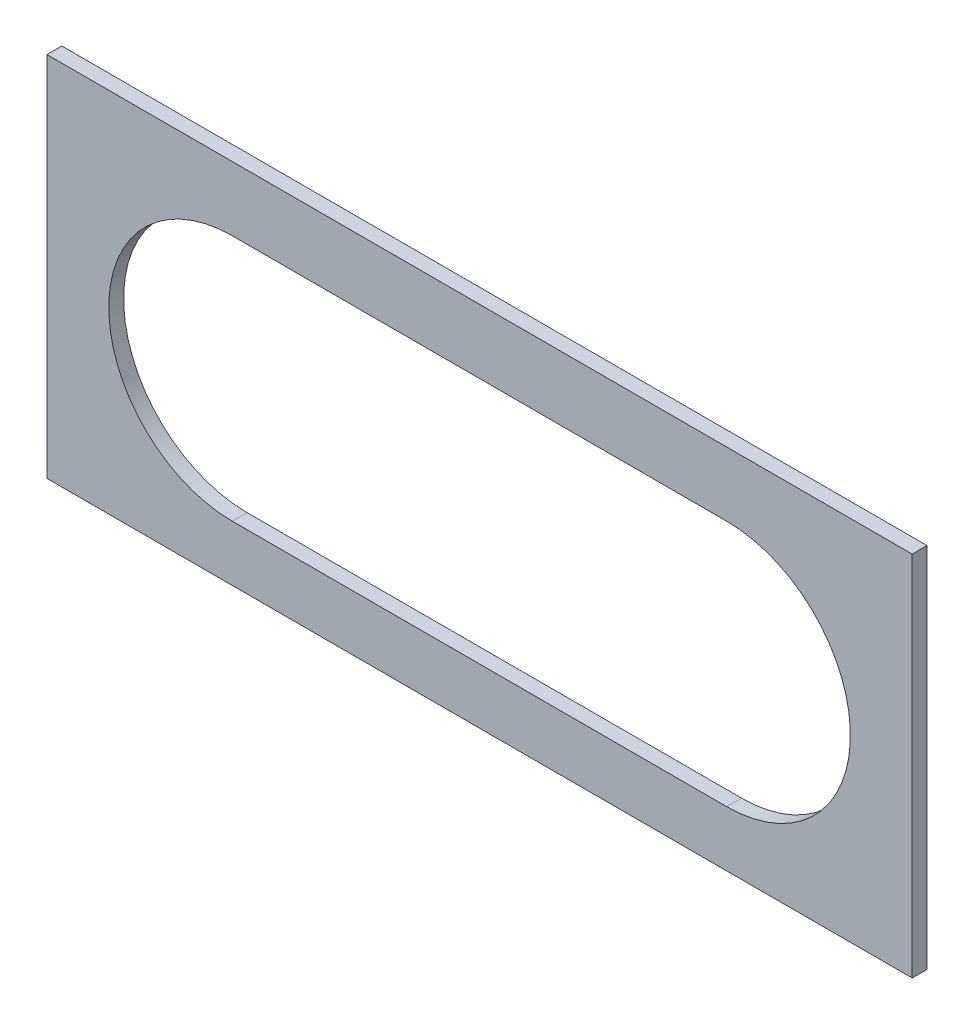
ISO-10303-21;
HEADER;
FILE_DESCRIPTION(('STEP AP214'),'2;1');
FILE_NAME('part.step','',(''),(''),'','','');
FILE_SCHEMA(('AUTOMOTIVE_DESIGN { 1 0 10303 214 1 1 1 1 }'));
ENDSEC;
DATA;
#1=APPLICATION_CONTEXT('core data for automotive mechanical design processes');
#2=APPLICATION_PROTOCOL_DEFINITION('international standard','automotive_design',2000,#1);
#3=PRODUCT_CONTEXT('',#1,'mechanical');
#4=PRODUCT('Part','Part','',(#3));
#5=PRODUCT_RELATED_PRODUCT_CATEGORY('part','',(#4));
#6=PRODUCT_DEFINITION_FORMATION('','',#4);
#7=PRODUCT_DEFINITION_CONTEXT('part definition',#1,'design');
#8=PRODUCT_DEFINITION('design','',#6,#7);
#9=PRODUCT_DEFINITION_SHAPE('','',#8);
#10=(LENGTH_UNIT() NAMED_UNIT(*) SI_UNIT(.MILLI.,.METRE.));
#11=(NAMED_UNIT(*) PLANE_ANGLE_UNIT() SI_UNIT($,.RADIAN.));
#12=(NAMED_UNIT(*) SI_UNIT($,.STERADIAN.) SOLID_ANGLE_UNIT());
#13=UNCERTAINTY_MEASURE_WITH_UNIT(LENGTH_MEASURE(1.E-05),#10,'distance_accuracy_value','');
#14=(GEOMETRIC_REPRESENTATION_CONTEXT(3) GLOBAL_UNCERTAINTY_ASSIGNED_CONTEXT((#13)) GLOBAL_UNIT_ASSIGNED_CONTEXT((#10,
#11,#12)) REPRESENTATION_CONTEXT('',''));
#15=CARTESIAN_POINT('',(0.,0.,0.));
#16=DIRECTION('',(0.,0.,1.));
#17=DIRECTION('',(1.,0.,0.));
#18=AXIS2_PLACEMENT_3D('',#15,#16,#17);
#19=CARTESIAN_POINT('',(0.,0.,12.));
#20=DIRECTION('',(0.,0.,1.));
#21=DIRECTION('',(1.,0.,0.));
#22=AXIS2_PLACEMENT_3D('',#19,#20,#21);
#23=PLANE('',#22);
#24=DIRECTION('',(0.,1.,0.));
#25=VECTOR('',#24,1.);
#26=CARTESIAN_POINT('',(350.,148.5,12.));
#27=LINE('',#26,#25);
#28=CARTESIAN_POINT('',(350.,-148.5,12.));
#29=VERTEX_POINT('',#28);
#30=CARTESIAN_POINT('',(350.,148.5,12.));
#31=VERTEX_POINT('',#30);
#32=EDGE_CURVE('E135',#29,#31,#27,.T.);
#33=ORIENTED_EDGE('',*,*,#32,.T.);
#34=DIRECTION('',(-1.,0.,0.));
#35=VECTOR('',#34,1.);
#36=CARTESIAN_POINT('',(-350.,148.5,12.));
#37=LINE('',#36,#35);
#38=CARTESIAN_POINT('',(-350.,148.5,12.));
#39=VERTEX_POINT('',#38);
#40=EDGE_CURVE('E138',#31,#39,#37,.T.);
#41=ORIENTED_EDGE('',*,*,#40,.T.);
#42=DIRECTION('',(0.,-1.,0.));
#43=VECTOR('',#42,1.);
#44=CARTESIAN_POINT('',(-350.,148.5,12.));
#45=LINE('',#44,#43);
#46=CARTESIAN_POINT('',(-350.,-148.5,12.));
#47=VERTEX_POINT('',#46);
#48=EDGE_CURVE('E141',#39,#47,#45,.T.);
#49=ORIENTED_EDGE('',*,*,#48,.T.);
#50=DIRECTION('',(1.,0.,0.));
#51=VECTOR('',#50,1.);
#52=CARTESIAN_POINT('',(-350.,-148.5,12.));
#53=LINE('',#52,#51);
#54=EDGE_CURVE('E143',#47,#29,#53,.T.);
#55=ORIENTED_EDGE('',*,*,#54,.T.);
#56=EDGE_LOOP('',(#33,#41,#49,#55));
#57=FACE_BOUND('',#56,.T.);
#58=DIRECTION('',(1.,0.,0.));
#59=VECTOR('',#58,1.);
#60=CARTESIAN_POINT('',(-200.,-103.5,12.));
#61=LINE('',#60,#59);
#62=CARTESIAN_POINT('',(-200.,-103.5,12.));
#63=VERTEX_POINT('',#62);
#64=CARTESIAN_POINT('',(200.,-103.5,12.));
#65=VERTEX_POINT('',#64);
#66=EDGE_CURVE('E107',#63,#65,#61,.T.);
#67=ORIENTED_EDGE('',*,*,#66,.F.);
#68=CARTESIAN_POINT('',(-200.,-3.50000000000003,12.));
#69=DIRECTION('',(0.,0.,1.));
#70=DIRECTION('',(1.,0.,0.));
#71=AXIS2_PLACEMENT_3D('',#68,#69,#70);
#72=CIRCLE('',#71,100.);
#73=CARTESIAN_POINT('',(-200.,96.5,12.));
#74=VERTEX_POINT('',#73);
#75=EDGE_CURVE('E99',#74,#63,#72,.T.);
#76=ORIENTED_EDGE('',*,*,#75,.F.);
#77=DIRECTION('',(-1.,0.,0.));
#78=VECTOR('',#77,1.);
#79=CARTESIAN_POINT('',(-200.,96.5,12.));
#80=LINE('',#79,#78);
#81=CARTESIAN_POINT('',(200.,96.4999999999999,12.));
#82=VERTEX_POINT('',#81);
#83=EDGE_CURVE('E121',#82,#74,#80,.T.);
#84=ORIENTED_EDGE('',*,*,#83,.F.);
#85=CARTESIAN_POINT('',(200.,-3.50000000000003,12.));
#86=DIRECTION('',(0.,0.,1.));
#87=DIRECTION('',(1.,0.,0.));
#88=AXIS2_PLACEMENT_3D('',#85,#86,#87);
#89=CIRCLE('',#88,100.);
#90=EDGE_CURVE('E119',#65,#82,#89,.T.);
#91=ORIENTED_EDGE('',*,*,#90,.F.);
#92=EDGE_LOOP('',(#67,#76,#84,#91));
#93=FACE_BOUND('',#92,.T.);
#94=ADVANCED_FACE('F34',(#57,#93),#23,.T.);
#95=CARTESIAN_POINT('',(0.,0.,0.));
#96=DIRECTION('',(0.,0.,1.));
#97=DIRECTION('',(1.,0.,0.));
#98=AXIS2_PLACEMENT_3D('',#95,#96,#97);
#99=PLANE('',#98);
#100=DIRECTION('',(0.,1.,0.));
#101=VECTOR('',#100,1.);
#102=CARTESIAN_POINT('',(350.,148.5,0.));
#103=LINE('',#102,#101);
#104=CARTESIAN_POINT('',(350.,-148.5,0.));
#105=VERTEX_POINT('',#104);
#106=CARTESIAN_POINT('',(350.,148.5,0.));
#107=VERTEX_POINT('',#106);
#108=EDGE_CURVE('E115',#105,#107,#103,.T.);
#109=ORIENTED_EDGE('',*,*,#108,.F.);
#110=DIRECTION('',(1.,0.,0.));
#111=VECTOR('',#110,1.);
#112=CARTESIAN_POINT('',(-350.,-148.5,0.));
#113=LINE('',#112,#111);
#114=CARTESIAN_POINT('',(-350.,-148.5,0.));
#115=VERTEX_POINT('',#114);
#116=EDGE_CURVE('E139',#115,#105,#113,.T.);
#117=ORIENTED_EDGE('',*,*,#116,.F.);
#118=DIRECTION('',(0.,-1.,0.));
#119=VECTOR('',#118,1.);
#120=CARTESIAN_POINT('',(-350.,148.5,0.));
#121=LINE('',#120,#119);
#122=CARTESIAN_POINT('',(-350.,148.5,0.));
#123=VERTEX_POINT('',#122);
#124=EDGE_CURVE('E150',#123,#115,#121,.T.);
#125=ORIENTED_EDGE('',*,*,#124,.F.);
#126=DIRECTION('',(-1.,0.,0.));
#127=VECTOR('',#126,1.);
#128=CARTESIAN_POINT('',(-350.,148.5,0.));
#129=LINE('',#128,#127);
#130=EDGE_CURVE('E148',#107,#123,#129,.T.);
#131=ORIENTED_EDGE('',*,*,#130,.F.);
#132=EDGE_LOOP('',(#109,#117,#125,#131));
#133=FACE_BOUND('',#132,.T.);
#134=CARTESIAN_POINT('',(-200.,-3.50000000000003,0.));
#135=DIRECTION('',(0.,0.,1.));
#136=DIRECTION('',(1.,0.,0.));
#137=AXIS2_PLACEMENT_3D('',#134,#135,#136);
#138=CIRCLE('',#137,100.);
#139=CARTESIAN_POINT('',(-200.,96.5,0.));
#140=VERTEX_POINT('',#139);
#141=CARTESIAN_POINT('',(-200.,-103.5,0.));
#142=VERTEX_POINT('',#141);
#143=EDGE_CURVE('E57',#140,#142,#138,.T.);
#144=ORIENTED_EDGE('',*,*,#143,.T.);
#145=DIRECTION('',(1.,0.,0.));
#146=VECTOR('',#145,1.);
#147=CARTESIAN_POINT('',(-200.,-103.5,0.));
#148=LINE('',#147,#146);
#149=CARTESIAN_POINT('',(200.,-103.5,0.));
#150=VERTEX_POINT('',#149);
#151=EDGE_CURVE('E114',#142,#150,#148,.T.);
#152=ORIENTED_EDGE('',*,*,#151,.T.);
#153=CARTESIAN_POINT('',(200.,-3.50000000000003,0.));
#154=DIRECTION('',(0.,0.,1.));
#155=DIRECTION('',(1.,0.,0.));
#156=AXIS2_PLACEMENT_3D('',#153,#154,#155);
#157=CIRCLE('',#156,100.);
#158=CARTESIAN_POINT('',(200.,96.4999999999999,0.));
#159=VERTEX_POINT('',#158);
#160=EDGE_CURVE('E127',#150,#159,#157,.T.);
#161=ORIENTED_EDGE('',*,*,#160,.T.);
#162=DIRECTION('',(-1.,0.,0.));
#163=VECTOR('',#162,1.);
#164=CARTESIAN_POINT('',(-200.,96.5,0.));
#165=LINE('',#164,#163);
#166=EDGE_CURVE('E108',#159,#140,#165,.T.);
#167=ORIENTED_EDGE('',*,*,#166,.T.);
#168=EDGE_LOOP('',(#144,#152,#161,#167));
#169=FACE_BOUND('',#168,.T.);
#170=ADVANCED_FACE('F168',(#133,#169),#99,.F.);
#171=CARTESIAN_POINT('',(350.,148.5,12.));
#172=DIRECTION('',(-1.,0.,0.));
#173=DIRECTION('',(0.,0.,1.));
#174=AXIS2_PLACEMENT_3D('',#171,#172,#173);
#175=PLANE('',#174);
#176=ORIENTED_EDGE('',*,*,#108,.T.);
#177=DIRECTION('',(0.,0.,-1.));
#178=VECTOR('',#177,1.);
#179=CARTESIAN_POINT('',(350.,148.5,12.));
#180=LINE('',#179,#178);
#181=EDGE_CURVE('E11',#31,#107,#180,.T.);
#182=ORIENTED_EDGE('',*,*,#181,.F.);
#183=ORIENTED_EDGE('',*,*,#32,.F.);
#184=DIRECTION('',(0.,0.,-1.));
#185=VECTOR('',#184,1.);
#186=CARTESIAN_POINT('',(350.,-148.5,12.));
#187=LINE('',#186,#185);
#188=EDGE_CURVE('E145',#29,#105,#187,.T.);
#189=ORIENTED_EDGE('',*,*,#188,.T.);
#190=EDGE_LOOP('',(#176,#182,#183,#189));
#191=FACE_BOUND('',#190,.T.);
#192=ADVANCED_FACE('F36',(#191),#175,.F.);
#193=CARTESIAN_POINT('',(-350.,148.5,12.));
#194=DIRECTION('',(0.,-1.,0.));
#195=DIRECTION('',(0.,0.,-1.));
#196=AXIS2_PLACEMENT_3D('',#193,#194,#195);
#197=PLANE('',#196);
#198=ORIENTED_EDGE('',*,*,#130,.T.);
#199=DIRECTION('',(0.,0.,-1.));
#200=VECTOR('',#199,1.);
#201=CARTESIAN_POINT('',(-350.,148.5,12.));
#202=LINE('',#201,#200);
#203=EDGE_CURVE('E42',#39,#123,#202,.T.);
#204=ORIENTED_EDGE('',*,*,#203,.F.);
#205=ORIENTED_EDGE('',*,*,#40,.F.);
#206=ORIENTED_EDGE('',*,*,#181,.T.);
#207=EDGE_LOOP('',(#198,#204,#205,#206));
#208=FACE_BOUND('',#207,.T.);
#209=ADVANCED_FACE('F178',(#208),#197,.F.);
#210=CARTESIAN_POINT('',(-350.,148.5,12.));
#211=DIRECTION('',(1.,0.,0.));
#212=DIRECTION('',(0.,1.,0.));
#213=AXIS2_PLACEMENT_3D('',#210,#211,#212);
#214=PLANE('',#213);
#215=ORIENTED_EDGE('',*,*,#124,.T.);
#216=DIRECTION('',(0.,0.,-1.));
#217=VECTOR('',#216,1.);
#218=CARTESIAN_POINT('',(-350.,-148.5,12.));
#219=LINE('',#218,#217);
#220=EDGE_CURVE('E155',#47,#115,#219,.T.);
#221=ORIENTED_EDGE('',*,*,#220,.F.);
#222=ORIENTED_EDGE('',*,*,#48,.F.);
#223=ORIENTED_EDGE('',*,*,#203,.T.);
#224=EDGE_LOOP('',(#215,#221,#222,#223));
#225=FACE_BOUND('',#224,.T.);
#226=ADVANCED_FACE('F162',(#225),#214,.F.);
#227=CARTESIAN_POINT('',(-350.,-148.5,12.));
#228=DIRECTION('',(0.,1.,0.));
#229=DIRECTION('',(0.,0.,1.));
#230=AXIS2_PLACEMENT_3D('',#227,#228,#229);
#231=PLANE('',#230);
#232=ORIENTED_EDGE('',*,*,#116,.T.);
#233=ORIENTED_EDGE('',*,*,#188,.F.);
#234=ORIENTED_EDGE('',*,*,#54,.F.);
#235=ORIENTED_EDGE('',*,*,#220,.T.);
#236=EDGE_LOOP('',(#232,#233,#234,#235));
#237=FACE_BOUND('',#236,.T.);
#238=ADVANCED_FACE('F172',(#237),#231,.F.);
#239=CARTESIAN_POINT('',(-200.,-3.50000000000003,12.));
#240=DIRECTION('',(0.,0.,-1.));
#241=DIRECTION('',(-1.,0.,0.));
#242=AXIS2_PLACEMENT_3D('',#239,#240,#241);
#243=CYLINDRICAL_SURFACE('',#242,100.);
#244=ORIENTED_EDGE('',*,*,#143,.F.);
#245=DIRECTION('',(0.,0.,-1.));
#246=VECTOR('',#245,1.);
#247=CARTESIAN_POINT('',(-200.,96.5,12.));
#248=LINE('',#247,#246);
#249=EDGE_CURVE('E103',#74,#140,#248,.T.);
#250=ORIENTED_EDGE('',*,*,#249,.F.);
#251=ORIENTED_EDGE('',*,*,#75,.T.);
#252=DIRECTION('',(0.,0.,-1.));
#253=VECTOR('',#252,1.);
#254=CARTESIAN_POINT('',(-200.,-103.5,12.));
#255=LINE('',#254,#253);
#256=EDGE_CURVE('E102',#63,#142,#255,.T.);
#257=ORIENTED_EDGE('',*,*,#256,.T.);
#258=EDGE_LOOP('',(#244,#250,#251,#257));
#259=FACE_BOUND('',#258,.T.);
#260=ADVANCED_FACE('F101',(#259),#243,.F.);
#261=CARTESIAN_POINT('',(-200.,-103.5,12.));
#262=DIRECTION('',(0.,1.,0.));
#263=DIRECTION('',(-1.,0.,0.));
#264=AXIS2_PLACEMENT_3D('',#261,#262,#263);
#265=PLANE('',#264);
#266=ORIENTED_EDGE('',*,*,#151,.F.);
#267=ORIENTED_EDGE('',*,*,#256,.F.);
#268=ORIENTED_EDGE('',*,*,#66,.T.);
#269=DIRECTION('',(0.,0.,-1.));
#270=VECTOR('',#269,1.);
#271=CARTESIAN_POINT('',(200.,-103.5,12.));
#272=LINE('',#271,#270);
#273=EDGE_CURVE('E116',#65,#150,#272,.T.);
#274=ORIENTED_EDGE('',*,*,#273,.T.);
#275=EDGE_LOOP('',(#266,#267,#268,#274));
#276=FACE_BOUND('',#275,.T.);
#277=ADVANCED_FACE('F111',(#276),#265,.T.);
#278=CARTESIAN_POINT('',(200.,-3.50000000000003,12.));
#279=DIRECTION('',(0.,0.,-1.));
#280=DIRECTION('',(-1.,0.,0.));
#281=AXIS2_PLACEMENT_3D('',#278,#279,#280);
#282=CYLINDRICAL_SURFACE('',#281,100.);
#283=ORIENTED_EDGE('',*,*,#160,.F.);
#284=ORIENTED_EDGE('',*,*,#273,.F.);
#285=ORIENTED_EDGE('',*,*,#90,.T.);
#286=DIRECTION('',(0.,0.,-1.));
#287=VECTOR('',#286,1.);
#288=CARTESIAN_POINT('',(200.,96.4999999999999,12.));
#289=LINE('',#288,#287);
#290=EDGE_CURVE('E49',#82,#159,#289,.T.);
#291=ORIENTED_EDGE('',*,*,#290,.T.);
#292=EDGE_LOOP('',(#283,#284,#285,#291));
#293=FACE_BOUND('',#292,.T.);
#294=ADVANCED_FACE('F201',(#293),#282,.F.);
#295=CARTESIAN_POINT('',(-200.,96.5,12.));
#296=DIRECTION('',(0.,-1.,0.));
#297=DIRECTION('',(1.,0.,0.));
#298=AXIS2_PLACEMENT_3D('',#295,#296,#297);
#299=PLANE('',#298);
#300=ORIENTED_EDGE('',*,*,#166,.F.);
#301=ORIENTED_EDGE('',*,*,#290,.F.);
#302=ORIENTED_EDGE('',*,*,#83,.T.);
#303=ORIENTED_EDGE('',*,*,#249,.T.);
#304=EDGE_LOOP('',(#300,#301,#302,#303));
#305=FACE_BOUND('',#304,.T.);
#306=ADVANCED_FACE('F205',(#305),#299,.T.);
#307=CLOSED_SHELL('',(#94,#170,#192,#209,#226,#238,#260,#277,#294,#306));
#308=MANIFOLD_SOLID_BREP('B2',#307);
#309=ADVANCED_BREP_SHAPE_REPRESENTATION('',(#18,#308),#14);
#310=SHAPE_DEFINITION_REPRESENTATION(#9,#309);
ENDSEC;
END-ISO-10303-21;
